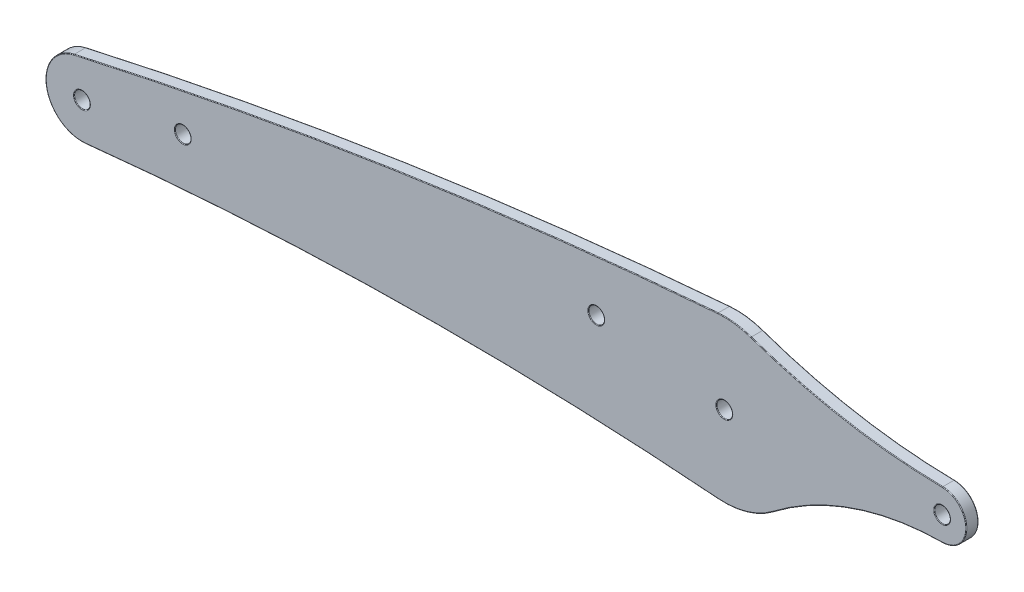
ISO-10303-21;
HEADER;
FILE_DESCRIPTION(('STEP AP214'),'2;1');
FILE_NAME('part.step','',(''),(''),'','','');
FILE_SCHEMA(('AUTOMOTIVE_DESIGN { 1 0 10303 214 1 1 1 1 }'));
ENDSEC;
DATA;
#1=APPLICATION_CONTEXT('core data for automotive mechanical design processes');
#2=APPLICATION_PROTOCOL_DEFINITION('international standard','automotive_design',2000,#1);
#3=PRODUCT_CONTEXT('',#1,'mechanical');
#4=PRODUCT('Part','Part','',(#3));
#5=PRODUCT_RELATED_PRODUCT_CATEGORY('part','',(#4));
#6=PRODUCT_DEFINITION_FORMATION('','',#4);
#7=PRODUCT_DEFINITION_CONTEXT('part definition',#1,'design');
#8=PRODUCT_DEFINITION('design','',#6,#7);
#9=PRODUCT_DEFINITION_SHAPE('','',#8);
#10=(LENGTH_UNIT() NAMED_UNIT(*) SI_UNIT(.MILLI.,.METRE.));
#11=(NAMED_UNIT(*) PLANE_ANGLE_UNIT() SI_UNIT($,.RADIAN.));
#12=(NAMED_UNIT(*) SI_UNIT($,.STERADIAN.) SOLID_ANGLE_UNIT());
#13=UNCERTAINTY_MEASURE_WITH_UNIT(LENGTH_MEASURE(1.E-05),#10,'distance_accuracy_value','');
#14=(GEOMETRIC_REPRESENTATION_CONTEXT(3) GLOBAL_UNCERTAINTY_ASSIGNED_CONTEXT((#13)) GLOBAL_UNIT_ASSIGNED_CONTEXT((#10,
#11,#12)) REPRESENTATION_CONTEXT('',''));
#15=CARTESIAN_POINT('',(0.,0.,0.));
#16=DIRECTION('',(0.,0.,1.));
#17=DIRECTION('',(1.,0.,0.));
#18=AXIS2_PLACEMENT_3D('',#15,#16,#17);
#19=CARTESIAN_POINT('',(-211.943109466389,188.84471337373,-3.));
#20=DIRECTION('',(0.,0.,1.));
#21=DIRECTION('',(1.,0.,0.));
#22=AXIS2_PLACEMENT_3D('',#19,#20,#21);
#23=CYLINDRICAL_SURFACE('',#22,9.00000000000004);
#24=DIRECTION('',(0.,0.,1.));
#25=VECTOR('',#24,1.);
#26=CARTESIAN_POINT('',(-213.918209682214,197.625315809636,-3.));
#27=LINE('',#26,#25);
#28=CARTESIAN_POINT('',(-213.918209682214,197.625315809636,-2.85));
#29=VERTEX_POINT('',#28);
#30=CARTESIAN_POINT('',(-213.918209682214,197.625315809636,-0.15));
#31=VERTEX_POINT('',#30);
#32=EDGE_CURVE('E152',#29,#31,#27,.T.);
#33=ORIENTED_EDGE('',*,*,#32,.F.);
#34=CARTESIAN_POINT('',(-211.943109466389,188.84471337373,-2.85));
#35=DIRECTION('',(0.,0.,1.));
#36=DIRECTION('',(1.,0.,0.));
#37=AXIS2_PLACEMENT_3D('',#34,#35,#36);
#38=CIRCLE('',#37,9.00000000000004);
#39=CARTESIAN_POINT('',(-210.990570029586,179.895262629615,-2.85));
#40=VERTEX_POINT('',#39);
#41=EDGE_CURVE('E147',#29,#40,#38,.T.);
#42=ORIENTED_EDGE('',*,*,#41,.T.);
#43=DIRECTION('',(0.,0.,1.));
#44=VECTOR('',#43,1.);
#45=CARTESIAN_POINT('',(-210.990570029586,179.895262629615,-3.));
#46=LINE('',#45,#44);
#47=CARTESIAN_POINT('',(-210.990570029586,179.895262629615,-0.15));
#48=VERTEX_POINT('',#47);
#49=EDGE_CURVE('E149',#40,#48,#46,.T.);
#50=ORIENTED_EDGE('',*,*,#49,.T.);
#51=CARTESIAN_POINT('',(-211.943109466389,188.84471337373,-0.15));
#52=DIRECTION('',(0.,0.,1.));
#53=DIRECTION('',(1.,0.,0.));
#54=AXIS2_PLACEMENT_3D('',#51,#52,#53);
#55=CIRCLE('',#54,9.00000000000004);
#56=EDGE_CURVE('E158',#48,#31,#55,.F.);
#57=ORIENTED_EDGE('',*,*,#56,.T.);
#58=EDGE_LOOP('',(#33,#42,#50,#57));
#59=FACE_BOUND('',#58,.T.);
#60=ADVANCED_FACE('F33',(#59),#23,.T.);
#61=CARTESIAN_POINT('',(38.4557067844307,-924.340551000619,-3.));
#62=DIRECTION('',(0.,0.,1.));
#63=DIRECTION('',(1.,0.,0.));
#64=AXIS2_PLACEMENT_3D('',#61,#62,#63);
#65=CYLINDRICAL_SURFACE('',#64,1150.);
#66=DIRECTION('',(0.,0.,1.));
#67=VECTOR('',#66,1.);
#68=CARTESIAN_POINT('',(-54.2798615977343,221.914269864636,-3.));
#69=LINE('',#68,#67);
#70=CARTESIAN_POINT('',(-54.2798615977343,221.914269864636,-2.85));
#71=VERTEX_POINT('',#70);
#72=CARTESIAN_POINT('',(-54.2798615977343,221.914269864636,-0.15));
#73=VERTEX_POINT('',#72);
#74=EDGE_CURVE('E369',#71,#73,#69,.T.);
#75=ORIENTED_EDGE('',*,*,#74,.F.);
#76=CARTESIAN_POINT('',(38.4557067844307,-924.340551000619,-2.85));
#77=DIRECTION('',(0.,0.,1.));
#78=DIRECTION('',(1.,0.,0.));
#79=AXIS2_PLACEMENT_3D('',#76,#77,#78);
#80=CIRCLE('',#79,1150.);
#81=EDGE_CURVE('E241',#71,#29,#80,.T.);
#82=ORIENTED_EDGE('',*,*,#81,.T.);
#83=ORIENTED_EDGE('',*,*,#32,.T.);
#84=CARTESIAN_POINT('',(38.4557067844307,-924.340551000619,-0.15));
#85=DIRECTION('',(0.,0.,1.));
#86=DIRECTION('',(1.,0.,0.));
#87=AXIS2_PLACEMENT_3D('',#84,#85,#86);
#88=CIRCLE('',#87,1150.);
#89=EDGE_CURVE('E238',#31,#73,#88,.F.);
#90=ORIENTED_EDGE('',*,*,#89,.T.);
#91=EDGE_LOOP('',(#75,#82,#83,#90));
#92=FACE_BOUND('',#91,.T.);
#93=ADVANCED_FACE('F375',(#92),#65,.T.);
#94=CARTESIAN_POINT('',(-52.6670691041315,201.979403414806,-3.));
#95=DIRECTION('',(0.,0.,1.));
#96=DIRECTION('',(1.,0.,0.));
#97=AXIS2_PLACEMENT_3D('',#94,#95,#96);
#98=CYLINDRICAL_SURFACE('',#97,19.9999999999998);
#99=DIRECTION('',(0.,0.,1.));
#100=VECTOR('',#99,1.);
#101=CARTESIAN_POINT('',(-46.0538445284684,220.854393764786,-3.));
#102=LINE('',#101,#100);
#103=CARTESIAN_POINT('',(-46.0538445284684,220.854393764786,-2.85));
#104=VERTEX_POINT('',#103);
#105=CARTESIAN_POINT('',(-46.0538445284684,220.854393764786,-0.15));
#106=VERTEX_POINT('',#105);
#107=EDGE_CURVE('E366',#104,#106,#102,.T.);
#108=ORIENTED_EDGE('',*,*,#107,.F.);
#109=CARTESIAN_POINT('',(-52.6670691041315,201.979403414806,-2.85));
#110=DIRECTION('',(0.,0.,1.));
#111=DIRECTION('',(1.,0.,0.));
#112=AXIS2_PLACEMENT_3D('',#109,#110,#111);
#113=CIRCLE('',#112,19.9999999999998);
#114=EDGE_CURVE('E236',#104,#71,#113,.T.);
#115=ORIENTED_EDGE('',*,*,#114,.T.);
#116=ORIENTED_EDGE('',*,*,#74,.T.);
#117=CARTESIAN_POINT('',(-52.6670691041315,201.979403414806,-0.15));
#118=DIRECTION('',(0.,0.,1.));
#119=DIRECTION('',(1.,0.,0.));
#120=AXIS2_PLACEMENT_3D('',#117,#118,#119);
#121=CIRCLE('',#120,19.9999999999998);
#122=EDGE_CURVE('E234',#73,#106,#121,.F.);
#123=ORIENTED_EDGE('',*,*,#122,.T.);
#124=EDGE_LOOP('',(#108,#115,#116,#123));
#125=FACE_BOUND('',#124,.T.);
#126=ADVANCED_FACE('F429',(#125),#98,.T.);
#127=CARTESIAN_POINT('',(3.54533978900547,362.416821389637,-3.));
#128=DIRECTION('',(0.,0.,1.));
#129=DIRECTION('',(1.,0.,0.));
#130=AXIS2_PLACEMENT_3D('',#127,#128,#129);
#131=CYLINDRICAL_SURFACE('',#130,150.);
#132=DIRECTION('',(0.,0.,1.));
#133=VECTOR('',#132,1.);
#134=CARTESIAN_POINT('',(1.41802354560448,212.431907062893,-3.));
#135=LINE('',#134,#133);
#136=CARTESIAN_POINT('',(1.41802354560448,212.431907062893,-2.85));
#137=VERTEX_POINT('',#136);
#138=CARTESIAN_POINT('',(1.41802354560448,212.431907062893,-0.15));
#139=VERTEX_POINT('',#138);
#140=EDGE_CURVE('E360',#137,#139,#135,.T.);
#141=ORIENTED_EDGE('',*,*,#140,.F.);
#142=CARTESIAN_POINT('',(3.54533978900547,362.416821389637,-2.85));
#143=DIRECTION('',(0.,0.,1.));
#144=DIRECTION('',(1.,0.,0.));
#145=AXIS2_PLACEMENT_3D('',#142,#143,#144);
#146=CIRCLE('',#145,150.);
#147=EDGE_CURVE('E232',#137,#104,#146,.F.);
#148=ORIENTED_EDGE('',*,*,#147,.T.);
#149=ORIENTED_EDGE('',*,*,#107,.T.);
#150=CARTESIAN_POINT('',(3.54533978900547,362.416821389637,-0.15));
#151=DIRECTION('',(0.,0.,1.));
#152=DIRECTION('',(1.,0.,0.));
#153=AXIS2_PLACEMENT_3D('',#150,#151,#152);
#154=CIRCLE('',#153,150.);
#155=EDGE_CURVE('E230',#106,#139,#154,.T.);
#156=ORIENTED_EDGE('',*,*,#155,.T.);
#157=EDGE_LOOP('',(#141,#148,#149,#156));
#158=FACE_BOUND('',#157,.T.);
#159=ADVANCED_FACE('F722',(#158),#131,.F.);
#160=CARTESIAN_POINT('',(1.33293089586844,206.432510489824,-3.));
#161=DIRECTION('',(0.,0.,1.));
#162=DIRECTION('',(1.,0.,0.));
#163=AXIS2_PLACEMENT_3D('',#160,#161,#162);
#164=CYLINDRICAL_SURFACE('',#163,5.99999999999999);
#165=DIRECTION('',(0.,0.,1.));
#166=VECTOR('',#165,1.);
#167=CARTESIAN_POINT('',(1.38046077506418,200.432698750228,-3.));
#168=LINE('',#167,#166);
#169=CARTESIAN_POINT('',(1.38046077506418,200.432698750228,-2.85));
#170=VERTEX_POINT('',#169);
#171=CARTESIAN_POINT('',(1.38046077506418,200.432698750228,-0.15));
#172=VERTEX_POINT('',#171);
#173=EDGE_CURVE('E356',#170,#172,#168,.T.);
#174=ORIENTED_EDGE('',*,*,#173,.F.);
#175=CARTESIAN_POINT('',(1.33293089586844,206.432510489824,-2.85));
#176=DIRECTION('',(0.,0.,1.));
#177=DIRECTION('',(1.,0.,0.));
#178=AXIS2_PLACEMENT_3D('',#175,#176,#177);
#179=CIRCLE('',#178,5.99999999999999);
#180=EDGE_CURVE('E228',#170,#137,#179,.T.);
#181=ORIENTED_EDGE('',*,*,#180,.T.);
#182=ORIENTED_EDGE('',*,*,#140,.T.);
#183=CARTESIAN_POINT('',(1.33293089586844,206.432510489824,-0.15));
#184=DIRECTION('',(0.,0.,1.));
#185=DIRECTION('',(1.,0.,0.));
#186=AXIS2_PLACEMENT_3D('',#183,#184,#185);
#187=CIRCLE('',#186,5.99999999999999);
#188=EDGE_CURVE('E226',#139,#172,#187,.F.);
#189=ORIENTED_EDGE('',*,*,#188,.T.);
#190=EDGE_LOOP('',(#174,#181,#182,#189));
#191=FACE_BOUND('',#190,.T.);
#192=ADVANCED_FACE('F714',(#191),#164,.T.);
#193=CARTESIAN_POINT('',(1.93497603234776,130.434895121619,-3.));
#194=DIRECTION('',(0.,0.,1.));
#195=DIRECTION('',(1.,0.,0.));
#196=AXIS2_PLACEMENT_3D('',#193,#194,#195);
#197=CYLINDRICAL_SURFACE('',#196,70.);
#198=DIRECTION('',(0.,0.,1.));
#199=VECTOR('',#198,1.);
#200=CARTESIAN_POINT('',(-40.5332812960251,186.080623794097,-3.));
#201=LINE('',#200,#199);
#202=CARTESIAN_POINT('',(-40.5332812960251,186.080623794097,-2.85));
#203=VERTEX_POINT('',#202);
#204=CARTESIAN_POINT('',(-40.5332812960251,186.080623794097,-0.15));
#205=VERTEX_POINT('',#204);
#206=EDGE_CURVE('E353',#203,#205,#201,.T.);
#207=ORIENTED_EDGE('',*,*,#206,.F.);
#208=CARTESIAN_POINT('',(1.93497603234776,130.434895121619,-2.85));
#209=DIRECTION('',(0.,0.,1.));
#210=DIRECTION('',(1.,0.,0.));
#211=AXIS2_PLACEMENT_3D('',#208,#209,#210);
#212=CIRCLE('',#211,70.);
#213=EDGE_CURVE('E224',#203,#170,#212,.F.);
#214=ORIENTED_EDGE('',*,*,#213,.T.);
#215=ORIENTED_EDGE('',*,*,#173,.T.);
#216=CARTESIAN_POINT('',(1.93497603234776,130.434895121619,-0.15));
#217=DIRECTION('',(0.,0.,1.));
#218=DIRECTION('',(1.,0.,0.));
#219=AXIS2_PLACEMENT_3D('',#216,#217,#218);
#220=CIRCLE('',#219,70.);
#221=EDGE_CURVE('E222',#172,#205,#220,.T.);
#222=ORIENTED_EDGE('',*,*,#221,.T.);
#223=EDGE_LOOP('',(#207,#214,#215,#222));
#224=FACE_BOUND('',#223,.T.);
#225=ADVANCED_FACE('F352',(#224),#197,.F.);
#226=CARTESIAN_POINT('',(-52.6670691041316,201.979403414805,-3.));
#227=DIRECTION('',(0.,0.,1.));
#228=DIRECTION('',(1.,0.,0.));
#229=AXIS2_PLACEMENT_3D('',#226,#227,#228);
#230=CYLINDRICAL_SURFACE('',#229,20.0000000000001);
#231=DIRECTION('',(0.,0.,1.));
#232=VECTOR('',#231,1.);
#233=CARTESIAN_POINT('',(-54.2385965295393,182.041241474667,-3.));
#234=LINE('',#233,#232);
#235=CARTESIAN_POINT('',(-54.2385965295393,182.041241474667,-2.85));
#236=VERTEX_POINT('',#235);
#237=CARTESIAN_POINT('',(-54.2385965295393,182.041241474667,-0.15));
#238=VERTEX_POINT('',#237);
#239=EDGE_CURVE('E169',#236,#238,#234,.T.);
#240=ORIENTED_EDGE('',*,*,#239,.F.);
#241=CARTESIAN_POINT('',(-52.6670691041316,201.979403414805,-2.85));
#242=DIRECTION('',(0.,0.,1.));
#243=DIRECTION('',(1.,0.,0.));
#244=AXIS2_PLACEMENT_3D('',#241,#242,#243);
#245=CIRCLE('',#244,20.0000000000001);
#246=EDGE_CURVE('E220',#236,#203,#245,.T.);
#247=ORIENTED_EDGE('',*,*,#246,.T.);
#248=ORIENTED_EDGE('',*,*,#206,.T.);
#249=CARTESIAN_POINT('',(-52.6670691041316,201.979403414805,-0.15));
#250=DIRECTION('',(0.,0.,1.));
#251=DIRECTION('',(1.,0.,0.));
#252=AXIS2_PLACEMENT_3D('',#249,#250,#251);
#253=CIRCLE('',#252,20.0000000000001);
#254=EDGE_CURVE('E218',#205,#238,#253,.F.);
#255=ORIENTED_EDGE('',*,*,#254,.T.);
#256=EDGE_LOOP('',(#240,#247,#248,#255));
#257=FACE_BOUND('',#256,.T.);
#258=ADVANCED_FACE('F358',(#257),#230,.T.);
#259=CARTESIAN_POINT('',(-121.028512109368,-665.330640981224,-3.));
#260=DIRECTION('',(0.,0.,1.));
#261=DIRECTION('',(1.,0.,0.));
#262=AXIS2_PLACEMENT_3D('',#259,#260,#261);
#263=CYLINDRICAL_SURFACE('',#262,850.);
#264=ORIENTED_EDGE('',*,*,#49,.F.);
#265=CARTESIAN_POINT('',(-121.028512109368,-665.330640981224,-2.85));
#266=DIRECTION('',(0.,0.,1.));
#267=DIRECTION('',(1.,0.,0.));
#268=AXIS2_PLACEMENT_3D('',#265,#266,#267);
#269=CIRCLE('',#268,850.);
#270=EDGE_CURVE('E165',#40,#236,#269,.F.);
#271=ORIENTED_EDGE('',*,*,#270,.T.);
#272=ORIENTED_EDGE('',*,*,#239,.T.);
#273=CARTESIAN_POINT('',(-121.028512109368,-665.330640981224,-0.15));
#274=DIRECTION('',(0.,0.,1.));
#275=DIRECTION('',(1.,0.,0.));
#276=AXIS2_PLACEMENT_3D('',#273,#274,#275);
#277=CIRCLE('',#276,850.);
#278=EDGE_CURVE('E168',#238,#48,#277,.T.);
#279=ORIENTED_EDGE('',*,*,#278,.T.);
#280=EDGE_LOOP('',(#264,#271,#272,#279));
#281=FACE_BOUND('',#280,.T.);
#282=ADVANCED_FACE('F162',(#281),#263,.F.);
#283=CARTESIAN_POINT('',(-166.485810787878,-238.242963803747,-3.));
#284=DIRECTION('',(0.,0.,1.));
#285=DIRECTION('',(1.,0.,0.));
#286=AXIS2_PLACEMENT_3D('',#283,#284,#285);
#287=PLANE('',#286);
#288=CARTESIAN_POINT('',(-52.6670691041316,201.979403414805,-3.));
#289=DIRECTION('',(0.,0.,1.));
#290=DIRECTION('',(1.,0.,0.));
#291=AXIS2_PLACEMENT_3D('',#288,#289,#290);
#292=CIRCLE('',#291,19.8500000000001);
#293=CARTESIAN_POINT('',(-40.6242847045858,186.199864641252,-3.));
#294=VERTEX_POINT('',#293);
#295=CARTESIAN_POINT('',(-54.2268100738487,182.190777689218,-3.));
#296=VERTEX_POINT('',#295);
#297=EDGE_CURVE('E214',#294,#296,#292,.F.);
#298=ORIENTED_EDGE('',*,*,#297,.T.);
#299=CARTESIAN_POINT('',(-121.028512109368,-665.330640981224,-3.));
#300=DIRECTION('',(0.,0.,1.));
#301=DIRECTION('',(1.,0.,0.));
#302=AXIS2_PLACEMENT_3D('',#299,#300,#301);
#303=CIRCLE('',#302,850.15);
#304=CARTESIAN_POINT('',(-211.006445686866,180.044420142017,-3.));
#305=VERTEX_POINT('',#304);
#306=EDGE_CURVE('E216',#296,#305,#303,.T.);
#307=ORIENTED_EDGE('',*,*,#306,.T.);
#308=CARTESIAN_POINT('',(-211.943109466389,188.84471337373,-3.));
#309=DIRECTION('',(0.,0.,1.));
#310=DIRECTION('',(1.,0.,0.));
#311=AXIS2_PLACEMENT_3D('',#308,#309,#310);
#312=CIRCLE('',#311,8.85000000000004);
#313=CARTESIAN_POINT('',(-213.885291345284,197.478972435705,-3.));
#314=VERTEX_POINT('',#313);
#315=EDGE_CURVE('E175',#305,#314,#312,.F.);
#316=ORIENTED_EDGE('',*,*,#315,.T.);
#317=CARTESIAN_POINT('',(38.4557067844307,-924.340551000619,-3.));
#318=DIRECTION('',(0.,0.,1.));
#319=DIRECTION('',(1.,0.,0.));
#320=AXIS2_PLACEMENT_3D('',#317,#318,#319);
#321=CIRCLE('',#320,1149.85);
#322=CARTESIAN_POINT('',(-54.2677656540323,221.764758366262,-3.));
#323=VERTEX_POINT('',#322);
#324=EDGE_CURVE('E204',#314,#323,#321,.F.);
#325=ORIENTED_EDGE('',*,*,#324,.T.);
#326=CARTESIAN_POINT('',(-52.6670691041315,201.979403414806,-3.));
#327=DIRECTION('',(0.,0.,1.));
#328=DIRECTION('',(1.,0.,0.));
#329=AXIS2_PLACEMENT_3D('',#326,#327,#328);
#330=CIRCLE('',#329,19.8499999999998);
#331=CARTESIAN_POINT('',(-46.1034437127859,220.712831337161,-3.));
#332=VERTEX_POINT('',#331);
#333=EDGE_CURVE('E206',#323,#332,#330,.F.);
#334=ORIENTED_EDGE('',*,*,#333,.T.);
#335=CARTESIAN_POINT('',(3.54533978900547,362.416821389637,-3.));
#336=DIRECTION('',(0.,0.,1.));
#337=DIRECTION('',(1.,0.,0.));
#338=AXIS2_PLACEMENT_3D('',#335,#336,#337);
#339=CIRCLE('',#338,150.15);
#340=CARTESIAN_POINT('',(1.41589622936108,212.281922148567,-3.));
#341=VERTEX_POINT('',#340);
#342=EDGE_CURVE('E208',#332,#341,#339,.T.);
#343=ORIENTED_EDGE('',*,*,#342,.T.);
#344=CARTESIAN_POINT('',(1.33293089586844,206.432510489824,-3.));
#345=DIRECTION('',(0.,0.,1.));
#346=DIRECTION('',(1.,0.,0.));
#347=AXIS2_PLACEMENT_3D('',#344,#345,#346);
#348=CIRCLE('',#347,5.84999999999999);
#349=CARTESIAN_POINT('',(1.37927252808429,200.582694043718,-3.));
#350=VERTEX_POINT('',#349);
#351=EDGE_CURVE('E210',#341,#350,#348,.F.);
#352=ORIENTED_EDGE('',*,*,#351,.T.);
#353=CARTESIAN_POINT('',(1.93497603234776,130.434895121619,-3.));
#354=DIRECTION('',(0.,0.,1.));
#355=DIRECTION('',(1.,0.,0.));
#356=AXIS2_PLACEMENT_3D('',#353,#354,#355);
#357=CIRCLE('',#356,70.15);
#358=EDGE_CURVE('E212',#350,#294,#357,.T.);
#359=ORIENTED_EDGE('',*,*,#358,.T.);
#360=EDGE_LOOP('',(#298,#307,#316,#325,#334,#343,#352,#359));
#361=FACE_BOUND('',#360,.T.);
#362=CARTESIAN_POINT('',(1.33293089586844,206.432510489824,-3.));
#363=DIRECTION('',(0.,0.,1.));
#364=DIRECTION('',(1.,0.,0.));
#365=AXIS2_PLACEMENT_3D('',#362,#363,#364);
#366=CIRCLE('',#365,2.09999999999999);
#367=CARTESIAN_POINT('',(3.43293089586843,206.432510489824,-3.));
#368=VERTEX_POINT('',#367);
#369=EDGE_CURVE('E200',#368,#368,#366,.T.);
#370=ORIENTED_EDGE('',*,*,#369,.T.);
#371=EDGE_LOOP('',(#370));
#372=FACE_BOUND('',#371,.T.);
#373=CARTESIAN_POINT('',(-52.6670691041316,201.979403414805,-3.));
#374=DIRECTION('',(0.,0.,1.));
#375=DIRECTION('',(1.,0.,0.));
#376=AXIS2_PLACEMENT_3D('',#373,#374,#375);
#377=CIRCLE('',#376,2.09999999999999);
#378=CARTESIAN_POINT('',(-50.5670691041316,201.979403414805,-3.));
#379=VERTEX_POINT('',#378);
#380=EDGE_CURVE('E197',#379,#379,#377,.T.);
#381=ORIENTED_EDGE('',*,*,#380,.T.);
#382=EDGE_LOOP('',(#381));
#383=FACE_BOUND('',#382,.T.);
#384=CARTESIAN_POINT('',(-84.4170691041315,206.371027021735,-3.));
#385=DIRECTION('',(0.,0.,1.));
#386=DIRECTION('',(1.,0.,0.));
#387=AXIS2_PLACEMENT_3D('',#384,#385,#386);
#388=CIRCLE('',#387,2.09999999999999);
#389=CARTESIAN_POINT('',(-82.3170691041316,206.371027021735,-3.));
#390=VERTEX_POINT('',#389);
#391=EDGE_CURVE('E194',#390,#390,#388,.T.);
#392=ORIENTED_EDGE('',*,*,#391,.T.);
#393=EDGE_LOOP('',(#392));
#394=FACE_BOUND('',#393,.T.);
#395=CARTESIAN_POINT('',(-186.943109466389,193.96421532943,-3.));
#396=DIRECTION('',(0.,0.,1.));
#397=DIRECTION('',(1.,0.,0.));
#398=AXIS2_PLACEMENT_3D('',#395,#396,#397);
#399=CIRCLE('',#398,2.09999999999998);
#400=CARTESIAN_POINT('',(-184.843109466389,193.96421532943,-3.));
#401=VERTEX_POINT('',#400);
#402=EDGE_CURVE('E188',#401,#401,#399,.T.);
#403=ORIENTED_EDGE('',*,*,#402,.T.);
#404=EDGE_LOOP('',(#403));
#405=FACE_BOUND('',#404,.T.);
#406=CARTESIAN_POINT('',(-211.943109466389,188.84471337373,-3.));
#407=DIRECTION('',(0.,0.,1.));
#408=DIRECTION('',(1.,0.,0.));
#409=AXIS2_PLACEMENT_3D('',#406,#407,#408);
#410=CIRCLE('',#409,2.09999999999998);
#411=CARTESIAN_POINT('',(-209.843109466389,188.84471337373,-3.));
#412=VERTEX_POINT('',#411);
#413=EDGE_CURVE('E185',#412,#412,#410,.T.);
#414=ORIENTED_EDGE('',*,*,#413,.T.);
#415=EDGE_LOOP('',(#414));
#416=FACE_BOUND('',#415,.T.);
#417=ADVANCED_FACE('F391',(#361,#372,#383,#394,#405,#416),#287,.F.);
#418=CARTESIAN_POINT('',(-166.485810787878,-238.242963803747,0.));
#419=DIRECTION('',(0.,0.,1.));
#420=DIRECTION('',(1.,0.,0.));
#421=AXIS2_PLACEMENT_3D('',#418,#419,#420);
#422=PLANE('',#421);
#423=CARTESIAN_POINT('',(-52.6670691041315,201.979403414806,0.));
#424=DIRECTION('',(0.,0.,1.));
#425=DIRECTION('',(1.,0.,0.));
#426=AXIS2_PLACEMENT_3D('',#423,#424,#425);
#427=CIRCLE('',#426,19.8499999999998);
#428=CARTESIAN_POINT('',(-46.1034437127859,220.712831337161,0.));
#429=VERTEX_POINT('',#428);
#430=CARTESIAN_POINT('',(-54.2677656540323,221.764758366262,0.));
#431=VERTEX_POINT('',#430);
#432=EDGE_CURVE('E42',#429,#431,#427,.T.);
#433=ORIENTED_EDGE('',*,*,#432,.T.);
#434=CARTESIAN_POINT('',(38.4557067844307,-924.340551000619,0.));
#435=DIRECTION('',(0.,0.,1.));
#436=DIRECTION('',(1.,0.,0.));
#437=AXIS2_PLACEMENT_3D('',#434,#435,#436);
#438=CIRCLE('',#437,1149.85);
#439=CARTESIAN_POINT('',(-213.885291345284,197.478972435705,0.));
#440=VERTEX_POINT('',#439);
#441=EDGE_CURVE('E11',#431,#440,#438,.T.);
#442=ORIENTED_EDGE('',*,*,#441,.T.);
#443=CARTESIAN_POINT('',(-211.943109466389,188.84471337373,0.));
#444=DIRECTION('',(0.,0.,1.));
#445=DIRECTION('',(1.,0.,0.));
#446=AXIS2_PLACEMENT_3D('',#443,#444,#445);
#447=CIRCLE('',#446,8.85000000000004);
#448=CARTESIAN_POINT('',(-211.006445686866,180.044420142017,0.));
#449=VERTEX_POINT('',#448);
#450=EDGE_CURVE('E288',#440,#449,#447,.T.);
#451=ORIENTED_EDGE('',*,*,#450,.T.);
#452=CARTESIAN_POINT('',(-121.028512109368,-665.330640981224,0.));
#453=DIRECTION('',(0.,0.,1.));
#454=DIRECTION('',(1.,0.,0.));
#455=AXIS2_PLACEMENT_3D('',#452,#453,#454);
#456=CIRCLE('',#455,850.15);
#457=CARTESIAN_POINT('',(-54.2268100738487,182.190777689218,0.));
#458=VERTEX_POINT('',#457);
#459=EDGE_CURVE('E290',#449,#458,#456,.F.);
#460=ORIENTED_EDGE('',*,*,#459,.T.);
#461=CARTESIAN_POINT('',(-52.6670691041316,201.979403414805,0.));
#462=DIRECTION('',(0.,0.,1.));
#463=DIRECTION('',(1.,0.,0.));
#464=AXIS2_PLACEMENT_3D('',#461,#462,#463);
#465=CIRCLE('',#464,19.8500000000001);
#466=CARTESIAN_POINT('',(-40.6242847045858,186.199864641252,0.));
#467=VERTEX_POINT('',#466);
#468=EDGE_CURVE('E292',#458,#467,#465,.T.);
#469=ORIENTED_EDGE('',*,*,#468,.T.);
#470=CARTESIAN_POINT('',(1.93497603234776,130.434895121619,0.));
#471=DIRECTION('',(0.,0.,1.));
#472=DIRECTION('',(1.,0.,0.));
#473=AXIS2_PLACEMENT_3D('',#470,#471,#472);
#474=CIRCLE('',#473,70.15);
#475=CARTESIAN_POINT('',(1.37927252808429,200.582694043718,0.));
#476=VERTEX_POINT('',#475);
#477=EDGE_CURVE('E294',#467,#476,#474,.F.);
#478=ORIENTED_EDGE('',*,*,#477,.T.);
#479=CARTESIAN_POINT('',(1.33293089586844,206.432510489824,0.));
#480=DIRECTION('',(0.,0.,1.));
#481=DIRECTION('',(1.,0.,0.));
#482=AXIS2_PLACEMENT_3D('',#479,#480,#481);
#483=CIRCLE('',#482,5.84999999999999);
#484=CARTESIAN_POINT('',(1.41589622936108,212.281922148567,0.));
#485=VERTEX_POINT('',#484);
#486=EDGE_CURVE('E296',#476,#485,#483,.T.);
#487=ORIENTED_EDGE('',*,*,#486,.T.);
#488=CARTESIAN_POINT('',(3.54533978900547,362.416821389637,0.));
#489=DIRECTION('',(0.,0.,1.));
#490=DIRECTION('',(1.,0.,0.));
#491=AXIS2_PLACEMENT_3D('',#488,#489,#490);
#492=CIRCLE('',#491,150.15);
#493=EDGE_CURVE('E53',#485,#429,#492,.F.);
#494=ORIENTED_EDGE('',*,*,#493,.T.);
#495=EDGE_LOOP('',(#433,#442,#451,#460,#469,#478,#487,#494));
#496=FACE_BOUND('',#495,.T.);
#497=CARTESIAN_POINT('',(1.33293089586844,206.432510489824,0.));
#498=DIRECTION('',(0.,0.,1.));
#499=DIRECTION('',(1.,0.,0.));
#500=AXIS2_PLACEMENT_3D('',#497,#498,#499);
#501=CIRCLE('',#500,2.09999999999999);
#502=CARTESIAN_POINT('',(3.43293089586843,206.432510489824,0.));
#503=VERTEX_POINT('',#502);
#504=EDGE_CURVE('E285',#503,#503,#501,.F.);
#505=ORIENTED_EDGE('',*,*,#504,.T.);
#506=EDGE_LOOP('',(#505));
#507=FACE_BOUND('',#506,.T.);
#508=CARTESIAN_POINT('',(-52.6670691041316,201.979403414805,0.));
#509=DIRECTION('',(0.,0.,1.));
#510=DIRECTION('',(1.,0.,0.));
#511=AXIS2_PLACEMENT_3D('',#508,#509,#510);
#512=CIRCLE('',#511,2.09999999999999);
#513=CARTESIAN_POINT('',(-50.5670691041316,201.979403414805,0.));
#514=VERTEX_POINT('',#513);
#515=EDGE_CURVE('E282',#514,#514,#512,.F.);
#516=ORIENTED_EDGE('',*,*,#515,.T.);
#517=EDGE_LOOP('',(#516));
#518=FACE_BOUND('',#517,.T.);
#519=CARTESIAN_POINT('',(-84.4170691041315,206.371027021735,0.));
#520=DIRECTION('',(0.,0.,1.));
#521=DIRECTION('',(1.,0.,0.));
#522=AXIS2_PLACEMENT_3D('',#519,#520,#521);
#523=CIRCLE('',#522,2.09999999999999);
#524=CARTESIAN_POINT('',(-82.3170691041316,206.371027021735,0.));
#525=VERTEX_POINT('',#524);
#526=EDGE_CURVE('E279',#525,#525,#523,.F.);
#527=ORIENTED_EDGE('',*,*,#526,.T.);
#528=EDGE_LOOP('',(#527));
#529=FACE_BOUND('',#528,.T.);
#530=CARTESIAN_POINT('',(-186.943109466389,193.96421532943,0.));
#531=DIRECTION('',(0.,0.,1.));
#532=DIRECTION('',(1.,0.,0.));
#533=AXIS2_PLACEMENT_3D('',#530,#531,#532);
#534=CIRCLE('',#533,2.09999999999998);
#535=CARTESIAN_POINT('',(-184.843109466389,193.96421532943,0.));
#536=VERTEX_POINT('',#535);
#537=EDGE_CURVE('E276',#536,#536,#534,.F.);
#538=ORIENTED_EDGE('',*,*,#537,.T.);
#539=EDGE_LOOP('',(#538));
#540=FACE_BOUND('',#539,.T.);
#541=CARTESIAN_POINT('',(-211.943109466389,188.84471337373,0.));
#542=DIRECTION('',(0.,0.,1.));
#543=DIRECTION('',(1.,0.,0.));
#544=AXIS2_PLACEMENT_3D('',#541,#542,#543);
#545=CIRCLE('',#544,2.09999999999998);
#546=CARTESIAN_POINT('',(-209.843109466389,188.84471337373,0.));
#547=VERTEX_POINT('',#546);
#548=EDGE_CURVE('E273',#547,#547,#545,.F.);
#549=ORIENTED_EDGE('',*,*,#548,.T.);
#550=EDGE_LOOP('',(#549));
#551=FACE_BOUND('',#550,.T.);
#552=ADVANCED_FACE('F387',(#496,#507,#518,#529,#540,#551),#422,.T.);
#553=CARTESIAN_POINT('',(1.33293089586844,206.432510489824,0.));
#554=DIRECTION('',(0.,0.,1.));
#555=DIRECTION('',(1.,0.,0.));
#556=AXIS2_PLACEMENT_3D('',#553,#554,#555);
#557=CYLINDRICAL_SURFACE('',#556,1.94999999999999);
#558=CARTESIAN_POINT('',(1.33293089586844,206.432510489824,-2.85));
#559=DIRECTION('',(0.,0.,1.));
#560=DIRECTION('',(1.,0.,0.));
#561=AXIS2_PLACEMENT_3D('',#558,#559,#560);
#562=CIRCLE('',#561,1.94999999999999);
#563=CARTESIAN_POINT('',(3.28293089586843,206.432510489824,-2.85));
#564=VERTEX_POINT('',#563);
#565=EDGE_CURVE('E246',#564,#564,#562,.F.);
#566=ORIENTED_EDGE('',*,*,#565,.T.);
#567=EDGE_LOOP('',(#566));
#568=FACE_BOUND('',#567,.T.);
#569=CARTESIAN_POINT('',(1.33293089586844,206.432510489824,-0.15));
#570=DIRECTION('',(0.,0.,1.));
#571=DIRECTION('',(1.,0.,0.));
#572=AXIS2_PLACEMENT_3D('',#569,#570,#571);
#573=CIRCLE('',#572,1.94999999999999);
#574=CARTESIAN_POINT('',(3.28293089586843,206.432510489824,-0.15));
#575=VERTEX_POINT('',#574);
#576=EDGE_CURVE('E157',#575,#575,#573,.T.);
#577=ORIENTED_EDGE('',*,*,#576,.T.);
#578=EDGE_LOOP('',(#577));
#579=FACE_BOUND('',#578,.T.);
#580=ADVANCED_FACE('F390',(#568,#579),#557,.F.);
#581=CARTESIAN_POINT('',(-52.6670691041316,201.979403414805,0.));
#582=DIRECTION('',(0.,0.,1.));
#583=DIRECTION('',(1.,0.,0.));
#584=AXIS2_PLACEMENT_3D('',#581,#582,#583);
#585=CYLINDRICAL_SURFACE('',#584,1.94999999999999);
#586=CARTESIAN_POINT('',(-52.6670691041316,201.979403414805,-2.85));
#587=DIRECTION('',(0.,0.,1.));
#588=DIRECTION('',(1.,0.,0.));
#589=AXIS2_PLACEMENT_3D('',#586,#587,#588);
#590=CIRCLE('',#589,1.94999999999999);
#591=CARTESIAN_POINT('',(-50.7170691041316,201.979403414805,-2.85));
#592=VERTEX_POINT('',#591);
#593=EDGE_CURVE('E252',#592,#592,#590,.F.);
#594=ORIENTED_EDGE('',*,*,#593,.T.);
#595=EDGE_LOOP('',(#594));
#596=FACE_BOUND('',#595,.T.);
#597=CARTESIAN_POINT('',(-52.6670691041316,201.979403414805,-0.15));
#598=DIRECTION('',(0.,0.,1.));
#599=DIRECTION('',(1.,0.,0.));
#600=AXIS2_PLACEMENT_3D('',#597,#598,#599);
#601=CIRCLE('',#600,1.94999999999999);
#602=CARTESIAN_POINT('',(-50.7170691041316,201.979403414805,-0.15));
#603=VERTEX_POINT('',#602);
#604=EDGE_CURVE('E249',#603,#603,#601,.T.);
#605=ORIENTED_EDGE('',*,*,#604,.T.);
#606=EDGE_LOOP('',(#605));
#607=FACE_BOUND('',#606,.T.);
#608=ADVANCED_FACE('F664',(#596,#607),#585,.F.);
#609=CARTESIAN_POINT('',(-84.4170691041315,206.371027021735,0.));
#610=DIRECTION('',(0.,0.,1.));
#611=DIRECTION('',(1.,0.,0.));
#612=AXIS2_PLACEMENT_3D('',#609,#610,#611);
#613=CYLINDRICAL_SURFACE('',#612,1.94999999999999);
#614=CARTESIAN_POINT('',(-84.4170691041315,206.371027021735,-2.85));
#615=DIRECTION('',(0.,0.,1.));
#616=DIRECTION('',(1.,0.,0.));
#617=AXIS2_PLACEMENT_3D('',#614,#615,#616);
#618=CIRCLE('',#617,1.94999999999999);
#619=CARTESIAN_POINT('',(-82.4670691041316,206.371027021735,-2.85));
#620=VERTEX_POINT('',#619);
#621=EDGE_CURVE('E258',#620,#620,#618,.F.);
#622=ORIENTED_EDGE('',*,*,#621,.T.);
#623=EDGE_LOOP('',(#622));
#624=FACE_BOUND('',#623,.T.);
#625=CARTESIAN_POINT('',(-84.4170691041315,206.371027021735,-0.15));
#626=DIRECTION('',(0.,0.,1.));
#627=DIRECTION('',(1.,0.,0.));
#628=AXIS2_PLACEMENT_3D('',#625,#626,#627);
#629=CIRCLE('',#628,1.94999999999999);
#630=CARTESIAN_POINT('',(-82.4670691041316,206.371027021735,-0.15));
#631=VERTEX_POINT('',#630);
#632=EDGE_CURVE('E255',#631,#631,#629,.T.);
#633=ORIENTED_EDGE('',*,*,#632,.T.);
#634=EDGE_LOOP('',(#633));
#635=FACE_BOUND('',#634,.T.);
#636=ADVANCED_FACE('F421',(#624,#635),#613,.F.);
#637=CARTESIAN_POINT('',(-186.943109466389,193.96421532943,0.));
#638=DIRECTION('',(0.,0.,1.));
#639=DIRECTION('',(1.,0.,0.));
#640=AXIS2_PLACEMENT_3D('',#637,#638,#639);
#641=CYLINDRICAL_SURFACE('',#640,1.94999999999998);
#642=CARTESIAN_POINT('',(-186.943109466389,193.96421532943,-2.85));
#643=DIRECTION('',(0.,0.,1.));
#644=DIRECTION('',(1.,0.,0.));
#645=AXIS2_PLACEMENT_3D('',#642,#643,#644);
#646=CIRCLE('',#645,1.94999999999998);
#647=CARTESIAN_POINT('',(-184.993109466389,193.96421532943,-2.85));
#648=VERTEX_POINT('',#647);
#649=EDGE_CURVE('E264',#648,#648,#646,.F.);
#650=ORIENTED_EDGE('',*,*,#649,.T.);
#651=EDGE_LOOP('',(#650));
#652=FACE_BOUND('',#651,.T.);
#653=CARTESIAN_POINT('',(-186.943109466389,193.96421532943,-0.15));
#654=DIRECTION('',(0.,0.,1.));
#655=DIRECTION('',(1.,0.,0.));
#656=AXIS2_PLACEMENT_3D('',#653,#654,#655);
#657=CIRCLE('',#656,1.94999999999998);
#658=CARTESIAN_POINT('',(-184.993109466389,193.96421532943,-0.15));
#659=VERTEX_POINT('',#658);
#660=EDGE_CURVE('E261',#659,#659,#657,.T.);
#661=ORIENTED_EDGE('',*,*,#660,.T.);
#662=EDGE_LOOP('',(#661));
#663=FACE_BOUND('',#662,.T.);
#664=ADVANCED_FACE('F411',(#652,#663),#641,.F.);
#665=CARTESIAN_POINT('',(-211.943109466389,188.84471337373,0.));
#666=DIRECTION('',(0.,0.,1.));
#667=DIRECTION('',(1.,0.,0.));
#668=AXIS2_PLACEMENT_3D('',#665,#666,#667);
#669=CYLINDRICAL_SURFACE('',#668,1.94999999999998);
#670=CARTESIAN_POINT('',(-211.943109466389,188.84471337373,-2.85));
#671=DIRECTION('',(0.,0.,1.));
#672=DIRECTION('',(1.,0.,0.));
#673=AXIS2_PLACEMENT_3D('',#670,#671,#672);
#674=CIRCLE('',#673,1.94999999999998);
#675=CARTESIAN_POINT('',(-209.993109466389,188.84471337373,-2.85));
#676=VERTEX_POINT('',#675);
#677=EDGE_CURVE('E270',#676,#676,#674,.F.);
#678=ORIENTED_EDGE('',*,*,#677,.T.);
#679=EDGE_LOOP('',(#678));
#680=FACE_BOUND('',#679,.T.);
#681=CARTESIAN_POINT('',(-211.943109466389,188.84471337373,-0.15));
#682=DIRECTION('',(0.,0.,1.));
#683=DIRECTION('',(1.,0.,0.));
#684=AXIS2_PLACEMENT_3D('',#681,#682,#683);
#685=CIRCLE('',#684,1.94999999999998);
#686=CARTESIAN_POINT('',(-209.993109466389,188.84471337373,-0.15));
#687=VERTEX_POINT('',#686);
#688=EDGE_CURVE('E267',#687,#687,#685,.T.);
#689=ORIENTED_EDGE('',*,*,#688,.T.);
#690=EDGE_LOOP('',(#689));
#691=FACE_BOUND('',#690,.T.);
#692=ADVANCED_FACE('F408',(#680,#691),#669,.F.);
#693=CARTESIAN_POINT('',(3.54533978900547,362.416821389637,-2.85));
#694=DIRECTION('',(0.,0.,1.));
#695=DIRECTION('',(1.,0.,0.));
#696=AXIS2_PLACEMENT_3D('',#693,#694,#695);
#697=TOROIDAL_SURFACE('',#696,150.15,0.15);
#698=CARTESIAN_POINT('',(1.41589622936108,212.281922148567,-2.85));
#699=DIRECTION('',(0.999899428844956,-0.0141821082893386,0.));
#700=DIRECTION('',(0.0141821082893386,0.999899428844956,0.));
#701=AXIS2_PLACEMENT_3D('',#698,#699,#700);
#702=CIRCLE('',#701,0.15);
#703=EDGE_CURVE('E311',#341,#137,#702,.T.);
#704=ORIENTED_EDGE('',*,*,#703,.F.);
#705=ORIENTED_EDGE('',*,*,#342,.F.);
#706=CARTESIAN_POINT('',(-46.1034437127859,220.712831337161,-2.85));
#707=DIRECTION('',(-0.943749517499015,0.330661228783142,0.));
#708=DIRECTION('',(-0.330661228783142,-0.943749517499015,0.));
#709=AXIS2_PLACEMENT_3D('',#706,#707,#708);
#710=CIRCLE('',#709,0.15);
#711=EDGE_CURVE('E170',#104,#332,#710,.T.);
#712=ORIENTED_EDGE('',*,*,#711,.F.);
#713=ORIENTED_EDGE('',*,*,#147,.F.);
#714=EDGE_LOOP('',(#704,#705,#712,#713));
#715=FACE_BOUND('',#714,.T.);
#716=ADVANCED_FACE('F410',(#715),#697,.T.);
#717=CARTESIAN_POINT('',(-52.6670691041315,201.979403414806,-2.85));
#718=DIRECTION('',(0.,0.,1.));
#719=DIRECTION('',(1.,0.,0.));
#720=AXIS2_PLACEMENT_3D('',#717,#718,#719);
#721=TOROIDAL_SURFACE('',#720,19.8499999999998,0.15);
#722=ORIENTED_EDGE('',*,*,#711,.T.);
#723=ORIENTED_EDGE('',*,*,#333,.F.);
#724=CARTESIAN_POINT('',(-54.2677656540323,221.764758366262,-2.85));
#725=DIRECTION('',(-0.996743322491525,-0.0806396246801564,0.));
#726=DIRECTION('',(0.0806396246801564,-0.996743322491525,0.));
#727=AXIS2_PLACEMENT_3D('',#724,#725,#726);
#728=CIRCLE('',#727,0.15);
#729=EDGE_CURVE('E308',#71,#323,#728,.T.);
#730=ORIENTED_EDGE('',*,*,#729,.F.);
#731=ORIENTED_EDGE('',*,*,#114,.F.);
#732=EDGE_LOOP('',(#722,#723,#730,#731));
#733=FACE_BOUND('',#732,.T.);
#734=ADVANCED_FACE('F418',(#733),#721,.T.);
#735=CARTESIAN_POINT('',(1.33293089586844,206.432510489824,-2.85));
#736=DIRECTION('',(0.,0.,1.));
#737=DIRECTION('',(1.,0.,0.));
#738=AXIS2_PLACEMENT_3D('',#735,#736,#737);
#739=TOROIDAL_SURFACE('',#738,5.84999999999999,0.15);
#740=ORIENTED_EDGE('',*,*,#703,.T.);
#741=ORIENTED_EDGE('',*,*,#180,.F.);
#742=CARTESIAN_POINT('',(1.37927252808429,200.582694043718,-2.85));
#743=DIRECTION('',(-0.999968623265856,-0.00792164653262237,0.));
#744=DIRECTION('',(0.00792164653262237,-0.999968623265856,0.));
#745=AXIS2_PLACEMENT_3D('',#742,#743,#744);
#746=CIRCLE('',#745,0.15);
#747=EDGE_CURVE('E305',#350,#170,#746,.T.);
#748=ORIENTED_EDGE('',*,*,#747,.F.);
#749=ORIENTED_EDGE('',*,*,#351,.F.);
#750=EDGE_LOOP('',(#740,#741,#748,#749));
#751=FACE_BOUND('',#750,.T.);
#752=ADVANCED_FACE('F450',(#751),#739,.T.);
#753=CARTESIAN_POINT('',(38.4557067844307,-924.340551000619,-2.85));
#754=DIRECTION('',(0.,0.,1.));
#755=DIRECTION('',(1.,0.,0.));
#756=AXIS2_PLACEMENT_3D('',#753,#754,#755);
#757=TOROIDAL_SURFACE('',#756,1149.85,0.15);
#758=ORIENTED_EDGE('',*,*,#729,.T.);
#759=ORIENTED_EDGE('',*,*,#324,.F.);
#760=CARTESIAN_POINT('',(-213.885291345284,197.478972435704,-2.85));
#761=DIRECTION('',(-0.975622492878497,-0.21945557953615,0.));
#762=DIRECTION('',(0.21945557953615,-0.975622492878497,0.));
#763=AXIS2_PLACEMENT_3D('',#760,#761,#762);
#764=CIRCLE('',#763,0.15);
#765=EDGE_CURVE('E303',#29,#314,#764,.T.);
#766=ORIENTED_EDGE('',*,*,#765,.F.);
#767=ORIENTED_EDGE('',*,*,#81,.F.);
#768=EDGE_LOOP('',(#758,#759,#766,#767));
#769=FACE_BOUND('',#768,.T.);
#770=ADVANCED_FACE('F446',(#769),#757,.T.);
#771=CARTESIAN_POINT('',(1.93497603234776,130.434895121619,-2.85));
#772=DIRECTION('',(0.,0.,1.));
#773=DIRECTION('',(1.,0.,0.));
#774=AXIS2_PLACEMENT_3D('',#771,#772,#773);
#775=TOROIDAL_SURFACE('',#774,70.15,0.15);
#776=ORIENTED_EDGE('',*,*,#747,.T.);
#777=ORIENTED_EDGE('',*,*,#213,.F.);
#778=CARTESIAN_POINT('',(-40.6242847045858,186.199864641252,-2.85));
#779=DIRECTION('',(-0.794938981035463,-0.606689390405255,0.));
#780=DIRECTION('',(0.606689390405255,-0.794938981035463,0.));
#781=AXIS2_PLACEMENT_3D('',#778,#779,#780);
#782=CIRCLE('',#781,0.15);
#783=EDGE_CURVE('E179',#294,#203,#782,.T.);
#784=ORIENTED_EDGE('',*,*,#783,.F.);
#785=ORIENTED_EDGE('',*,*,#358,.F.);
#786=EDGE_LOOP('',(#776,#777,#784,#785));
#787=FACE_BOUND('',#786,.T.);
#788=ADVANCED_FACE('F443',(#787),#775,.T.);
#789=CARTESIAN_POINT('',(-211.943109466389,188.84471337373,-2.85));
#790=DIRECTION('',(0.,0.,1.));
#791=DIRECTION('',(1.,0.,0.));
#792=AXIS2_PLACEMENT_3D('',#789,#790,#791);
#793=TOROIDAL_SURFACE('',#792,8.85000000000004,0.15);
#794=ORIENTED_EDGE('',*,*,#765,.T.);
#795=ORIENTED_EDGE('',*,*,#315,.F.);
#796=CARTESIAN_POINT('',(-211.006445686866,180.044420142017,-2.85));
#797=DIRECTION('',(0.994383416012754,0.105837715200232,0.));
#798=DIRECTION('',(-0.105837715200232,0.994383416012754,0.));
#799=AXIS2_PLACEMENT_3D('',#796,#797,#798);
#800=CIRCLE('',#799,0.15);
#801=EDGE_CURVE('E173',#40,#305,#800,.T.);
#802=ORIENTED_EDGE('',*,*,#801,.F.);
#803=ORIENTED_EDGE('',*,*,#41,.F.);
#804=EDGE_LOOP('',(#794,#795,#802,#803));
#805=FACE_BOUND('',#804,.T.);
#806=ADVANCED_FACE('F174',(#805),#793,.T.);
#807=CARTESIAN_POINT('',(-52.6670691041316,201.979403414805,-2.85));
#808=DIRECTION('',(0.,0.,1.));
#809=DIRECTION('',(1.,0.,0.));
#810=AXIS2_PLACEMENT_3D('',#807,#808,#809);
#811=TOROIDAL_SURFACE('',#810,19.8500000000001,0.15);
#812=ORIENTED_EDGE('',*,*,#783,.T.);
#813=ORIENTED_EDGE('',*,*,#246,.F.);
#814=CARTESIAN_POINT('',(-54.2268100738487,182.190777689218,-2.85));
#815=DIRECTION('',(-0.996908097006927,0.0785763712704187,0.));
#816=DIRECTION('',(-0.0785763712704187,-0.996908097006927,0.));
#817=AXIS2_PLACEMENT_3D('',#814,#815,#816);
#818=CIRCLE('',#817,0.15);
#819=EDGE_CURVE('E180',#296,#236,#818,.T.);
#820=ORIENTED_EDGE('',*,*,#819,.F.);
#821=ORIENTED_EDGE('',*,*,#297,.F.);
#822=EDGE_LOOP('',(#812,#813,#820,#821));
#823=FACE_BOUND('',#822,.T.);
#824=ADVANCED_FACE('F437',(#823),#811,.T.);
#825=CARTESIAN_POINT('',(-121.028512109368,-665.330640981224,-2.85));
#826=DIRECTION('',(0.,0.,1.));
#827=DIRECTION('',(1.,0.,0.));
#828=AXIS2_PLACEMENT_3D('',#825,#826,#827);
#829=TOROIDAL_SURFACE('',#828,850.15,0.15);
#830=ORIENTED_EDGE('',*,*,#801,.T.);
#831=ORIENTED_EDGE('',*,*,#306,.F.);
#832=ORIENTED_EDGE('',*,*,#819,.T.);
#833=ORIENTED_EDGE('',*,*,#270,.F.);
#834=EDGE_LOOP('',(#830,#831,#832,#833));
#835=FACE_BOUND('',#834,.T.);
#836=ADVANCED_FACE('F182',(#835),#829,.T.);
#837=CARTESIAN_POINT('',(1.33293089586844,206.432510489824,-2.85));
#838=DIRECTION('',(0.,0.,1.));
#839=DIRECTION('',(1.,0.,0.));
#840=AXIS2_PLACEMENT_3D('',#837,#838,#839);
#841=TOROIDAL_SURFACE('',#840,2.09999999999999,0.15);
#842=ORIENTED_EDGE('',*,*,#565,.F.);
#843=EDGE_LOOP('',(#842));
#844=FACE_BOUND('',#843,.T.);
#845=ORIENTED_EDGE('',*,*,#369,.F.);
#846=EDGE_LOOP('',(#845));
#847=FACE_BOUND('',#846,.T.);
#848=ADVANCED_FACE('F436',(#844,#847),#841,.T.);
#849=CARTESIAN_POINT('',(-52.6670691041316,201.979403414805,-2.85));
#850=DIRECTION('',(0.,0.,1.));
#851=DIRECTION('',(1.,0.,0.));
#852=AXIS2_PLACEMENT_3D('',#849,#850,#851);
#853=TOROIDAL_SURFACE('',#852,2.09999999999999,0.15);
#854=ORIENTED_EDGE('',*,*,#593,.F.);
#855=EDGE_LOOP('',(#854));
#856=FACE_BOUND('',#855,.T.);
#857=ORIENTED_EDGE('',*,*,#380,.F.);
#858=EDGE_LOOP('',(#857));
#859=FACE_BOUND('',#858,.T.);
#860=ADVANCED_FACE('F460',(#856,#859),#853,.T.);
#861=CARTESIAN_POINT('',(-84.4170691041315,206.371027021735,-2.85));
#862=DIRECTION('',(0.,0.,1.));
#863=DIRECTION('',(1.,0.,0.));
#864=AXIS2_PLACEMENT_3D('',#861,#862,#863);
#865=TOROIDAL_SURFACE('',#864,2.09999999999999,0.15);
#866=ORIENTED_EDGE('',*,*,#621,.F.);
#867=EDGE_LOOP('',(#866));
#868=FACE_BOUND('',#867,.T.);
#869=ORIENTED_EDGE('',*,*,#391,.F.);
#870=EDGE_LOOP('',(#869));
#871=FACE_BOUND('',#870,.T.);
#872=ADVANCED_FACE('F464',(#868,#871),#865,.T.);
#873=CARTESIAN_POINT('',(-186.943109466389,193.96421532943,-2.85));
#874=DIRECTION('',(0.,0.,1.));
#875=DIRECTION('',(1.,0.,0.));
#876=AXIS2_PLACEMENT_3D('',#873,#874,#875);
#877=TOROIDAL_SURFACE('',#876,2.09999999999998,0.15);
#878=ORIENTED_EDGE('',*,*,#649,.F.);
#879=EDGE_LOOP('',(#878));
#880=FACE_BOUND('',#879,.T.);
#881=ORIENTED_EDGE('',*,*,#402,.F.);
#882=EDGE_LOOP('',(#881));
#883=FACE_BOUND('',#882,.T.);
#884=ADVANCED_FACE('F468',(#880,#883),#877,.T.);
#885=CARTESIAN_POINT('',(-211.943109466389,188.84471337373,-2.85));
#886=DIRECTION('',(0.,0.,1.));
#887=DIRECTION('',(1.,0.,0.));
#888=AXIS2_PLACEMENT_3D('',#885,#886,#887);
#889=TOROIDAL_SURFACE('',#888,2.09999999999998,0.15);
#890=ORIENTED_EDGE('',*,*,#677,.F.);
#891=EDGE_LOOP('',(#890));
#892=FACE_BOUND('',#891,.T.);
#893=ORIENTED_EDGE('',*,*,#413,.F.);
#894=EDGE_LOOP('',(#893));
#895=FACE_BOUND('',#894,.T.);
#896=ADVANCED_FACE('F472',(#892,#895),#889,.T.);
#897=CARTESIAN_POINT('',(1.93497603234776,130.434895121619,-0.15));
#898=DIRECTION('',(0.,0.,1.));
#899=DIRECTION('',(1.,0.,0.));
#900=AXIS2_PLACEMENT_3D('',#897,#898,#899);
#901=TOROIDAL_SURFACE('',#900,70.15,0.15);
#902=CARTESIAN_POINT('',(-40.6242847045858,186.199864641252,-0.15));
#903=DIRECTION('',(-0.794938981035418,-0.606689390405313,0.));
#904=DIRECTION('',(0.606689390405313,-0.794938981035418,0.));
#905=AXIS2_PLACEMENT_3D('',#902,#903,#904);
#906=CIRCLE('',#905,0.15);
#907=EDGE_CURVE('E331',#205,#467,#906,.T.);
#908=ORIENTED_EDGE('',*,*,#907,.F.);
#909=ORIENTED_EDGE('',*,*,#221,.F.);
#910=CARTESIAN_POINT('',(1.37927252808429,200.582694043718,-0.15));
#911=DIRECTION('',(0.999968623265856,0.00792164653262239,0.));
#912=DIRECTION('',(-0.00792164653262239,0.999968623265856,0.));
#913=AXIS2_PLACEMENT_3D('',#910,#911,#912);
#914=CIRCLE('',#913,0.15);
#915=EDGE_CURVE('E37',#476,#172,#914,.T.);
#916=ORIENTED_EDGE('',*,*,#915,.F.);
#917=ORIENTED_EDGE('',*,*,#477,.F.);
#918=EDGE_LOOP('',(#908,#909,#916,#917));
#919=FACE_BOUND('',#918,.T.);
#920=ADVANCED_FACE('F347',(#919),#901,.T.);
#921=CARTESIAN_POINT('',(1.33293089586844,206.432510489824,-0.15));
#922=DIRECTION('',(0.,0.,1.));
#923=DIRECTION('',(1.,0.,0.));
#924=AXIS2_PLACEMENT_3D('',#921,#922,#923);
#925=TOROIDAL_SURFACE('',#924,5.84999999999999,0.15);
#926=ORIENTED_EDGE('',*,*,#915,.T.);
#927=ORIENTED_EDGE('',*,*,#188,.F.);
#928=CARTESIAN_POINT('',(1.41589622936108,212.281922148567,-0.15));
#929=DIRECTION('',(-0.999899428844956,0.01418210828934,0.));
#930=DIRECTION('',(-0.01418210828934,-0.999899428844956,0.));
#931=AXIS2_PLACEMENT_3D('',#928,#929,#930);
#932=CIRCLE('',#931,0.15);
#933=EDGE_CURVE('E329',#485,#139,#932,.T.);
#934=ORIENTED_EDGE('',*,*,#933,.F.);
#935=ORIENTED_EDGE('',*,*,#486,.F.);
#936=EDGE_LOOP('',(#926,#927,#934,#935));
#937=FACE_BOUND('',#936,.T.);
#938=ADVANCED_FACE('F342',(#937),#925,.T.);
#939=CARTESIAN_POINT('',(-52.6670691041316,201.979403414805,-0.15));
#940=DIRECTION('',(0.,0.,1.));
#941=DIRECTION('',(1.,0.,0.));
#942=AXIS2_PLACEMENT_3D('',#939,#940,#941);
#943=TOROIDAL_SURFACE('',#942,19.8500000000001,0.15);
#944=ORIENTED_EDGE('',*,*,#907,.T.);
#945=ORIENTED_EDGE('',*,*,#468,.F.);
#946=CARTESIAN_POINT('',(-54.2268100738487,182.190777689218,-0.15));
#947=DIRECTION('',(-0.996908097006929,0.0785763712704042,0.));
#948=DIRECTION('',(-0.0785763712704042,-0.996908097006929,0.));
#949=AXIS2_PLACEMENT_3D('',#946,#947,#948);
#950=CIRCLE('',#949,0.15);
#951=EDGE_CURVE('E326',#238,#458,#950,.T.);
#952=ORIENTED_EDGE('',*,*,#951,.F.);
#953=ORIENTED_EDGE('',*,*,#254,.F.);
#954=EDGE_LOOP('',(#944,#945,#952,#953));
#955=FACE_BOUND('',#954,.T.);
#956=ADVANCED_FACE('F493',(#955),#943,.T.);
#957=CARTESIAN_POINT('',(3.54533978900547,362.416821389637,-0.15));
#958=DIRECTION('',(0.,0.,1.));
#959=DIRECTION('',(1.,0.,0.));
#960=AXIS2_PLACEMENT_3D('',#957,#958,#959);
#961=TOROIDAL_SURFACE('',#960,150.15,0.15);
#962=ORIENTED_EDGE('',*,*,#933,.T.);
#963=ORIENTED_EDGE('',*,*,#155,.F.);
#964=CARTESIAN_POINT('',(-46.1034437127859,220.712831337161,-0.15));
#965=DIRECTION('',(-0.943749517499,0.330661228783183,0.));
#966=DIRECTION('',(-0.330661228783183,-0.943749517499,0.));
#967=AXIS2_PLACEMENT_3D('',#964,#965,#966);
#968=CIRCLE('',#967,0.15);
#969=EDGE_CURVE('E323',#429,#106,#968,.T.);
#970=ORIENTED_EDGE('',*,*,#969,.F.);
#971=ORIENTED_EDGE('',*,*,#493,.F.);
#972=EDGE_LOOP('',(#962,#963,#970,#971));
#973=FACE_BOUND('',#972,.T.);
#974=ADVANCED_FACE('F489',(#973),#961,.T.);
#975=CARTESIAN_POINT('',(-121.028512109368,-665.330640981224,-0.15));
#976=DIRECTION('',(0.,0.,1.));
#977=DIRECTION('',(1.,0.,0.));
#978=AXIS2_PLACEMENT_3D('',#975,#976,#977);
#979=TOROIDAL_SURFACE('',#978,850.15,0.15);
#980=ORIENTED_EDGE('',*,*,#951,.T.);
#981=ORIENTED_EDGE('',*,*,#459,.F.);
#982=CARTESIAN_POINT('',(-211.006445686866,180.044420142017,-0.15));
#983=DIRECTION('',(-0.994383416012754,-0.105837715200232,0.));
#984=DIRECTION('',(0.105837715200232,-0.994383416012754,0.));
#985=AXIS2_PLACEMENT_3D('',#982,#983,#984);
#986=CIRCLE('',#985,0.15);
#987=EDGE_CURVE('E320',#48,#449,#986,.T.);
#988=ORIENTED_EDGE('',*,*,#987,.F.);
#989=ORIENTED_EDGE('',*,*,#278,.F.);
#990=EDGE_LOOP('',(#980,#981,#988,#989));
#991=FACE_BOUND('',#990,.T.);
#992=ADVANCED_FACE('F485',(#991),#979,.T.);
#993=CARTESIAN_POINT('',(-52.6670691041315,201.979403414806,-0.15));
#994=DIRECTION('',(0.,0.,1.));
#995=DIRECTION('',(1.,0.,0.));
#996=AXIS2_PLACEMENT_3D('',#993,#994,#995);
#997=TOROIDAL_SURFACE('',#996,19.8499999999998,0.15);
#998=ORIENTED_EDGE('',*,*,#969,.T.);
#999=ORIENTED_EDGE('',*,*,#122,.F.);
#1000=CARTESIAN_POINT('',(-54.2677656540323,221.764758366262,-0.15));
#1001=DIRECTION('',(-0.996743322491526,-0.0806396246801415,0.));
#1002=DIRECTION('',(0.0806396246801415,-0.996743322491526,0.));
#1003=AXIS2_PLACEMENT_3D('',#1000,#1001,#1002);
#1004=CIRCLE('',#1003,0.15);
#1005=EDGE_CURVE('E318',#431,#73,#1004,.T.);
#1006=ORIENTED_EDGE('',*,*,#1005,.F.);
#1007=ORIENTED_EDGE('',*,*,#432,.F.);
#1008=EDGE_LOOP('',(#998,#999,#1006,#1007));
#1009=FACE_BOUND('',#1008,.T.);
#1010=ADVANCED_FACE('F482',(#1009),#997,.T.);
#1011=CARTESIAN_POINT('',(-211.943109466389,188.84471337373,-0.15));
#1012=DIRECTION('',(0.,0.,1.));
#1013=DIRECTION('',(1.,0.,0.));
#1014=AXIS2_PLACEMENT_3D('',#1011,#1012,#1013);
#1015=TOROIDAL_SURFACE('',#1014,8.85000000000004,0.15);
#1016=ORIENTED_EDGE('',*,*,#987,.T.);
#1017=ORIENTED_EDGE('',*,*,#450,.F.);
#1018=CARTESIAN_POINT('',(-213.885291345284,197.478972435705,-0.15));
#1019=DIRECTION('',(0.975622492878497,0.21945557953615,0.));
#1020=DIRECTION('',(-0.21945557953615,0.975622492878497,0.));
#1021=AXIS2_PLACEMENT_3D('',#1018,#1019,#1020);
#1022=CIRCLE('',#1021,0.15);
#1023=EDGE_CURVE('E316',#31,#440,#1022,.T.);
#1024=ORIENTED_EDGE('',*,*,#1023,.F.);
#1025=ORIENTED_EDGE('',*,*,#56,.F.);
#1026=EDGE_LOOP('',(#1016,#1017,#1024,#1025));
#1027=FACE_BOUND('',#1026,.T.);
#1028=ADVANCED_FACE('F385',(#1027),#1015,.T.);
#1029=CARTESIAN_POINT('',(38.4557067844307,-924.340551000619,-0.15));
#1030=DIRECTION('',(0.,0.,1.));
#1031=DIRECTION('',(1.,0.,0.));
#1032=AXIS2_PLACEMENT_3D('',#1029,#1030,#1031);
#1033=TOROIDAL_SURFACE('',#1032,1149.85,0.15);
#1034=ORIENTED_EDGE('',*,*,#1005,.T.);
#1035=ORIENTED_EDGE('',*,*,#89,.F.);
#1036=ORIENTED_EDGE('',*,*,#1023,.T.);
#1037=ORIENTED_EDGE('',*,*,#441,.F.);
#1038=EDGE_LOOP('',(#1034,#1035,#1036,#1037));
#1039=FACE_BOUND('',#1038,.T.);
#1040=ADVANCED_FACE('F379',(#1039),#1033,.T.);
#1041=CARTESIAN_POINT('',(1.33293089586844,206.432510489824,-0.15));
#1042=DIRECTION('',(0.,0.,1.));
#1043=DIRECTION('',(1.,0.,0.));
#1044=AXIS2_PLACEMENT_3D('',#1041,#1042,#1043);
#1045=TOROIDAL_SURFACE('',#1044,2.09999999999999,0.15);
#1046=ORIENTED_EDGE('',*,*,#504,.F.);
#1047=EDGE_LOOP('',(#1046));
#1048=FACE_BOUND('',#1047,.T.);
#1049=ORIENTED_EDGE('',*,*,#576,.F.);
#1050=EDGE_LOOP('',(#1049));
#1051=FACE_BOUND('',#1050,.T.);
#1052=ADVANCED_FACE('F479',(#1048,#1051),#1045,.T.);
#1053=CARTESIAN_POINT('',(-52.6670691041316,201.979403414805,-0.15));
#1054=DIRECTION('',(0.,0.,1.));
#1055=DIRECTION('',(1.,0.,0.));
#1056=AXIS2_PLACEMENT_3D('',#1053,#1054,#1055);
#1057=TOROIDAL_SURFACE('',#1056,2.09999999999999,0.15);
#1058=ORIENTED_EDGE('',*,*,#515,.F.);
#1059=EDGE_LOOP('',(#1058));
#1060=FACE_BOUND('',#1059,.T.);
#1061=ORIENTED_EDGE('',*,*,#604,.F.);
#1062=EDGE_LOOP('',(#1061));
#1063=FACE_BOUND('',#1062,.T.);
#1064=ADVANCED_FACE('F503',(#1060,#1063),#1057,.T.);
#1065=CARTESIAN_POINT('',(-84.4170691041315,206.371027021735,-0.15));
#1066=DIRECTION('',(0.,0.,1.));
#1067=DIRECTION('',(1.,0.,0.));
#1068=AXIS2_PLACEMENT_3D('',#1065,#1066,#1067);
#1069=TOROIDAL_SURFACE('',#1068,2.09999999999999,0.15);
#1070=ORIENTED_EDGE('',*,*,#526,.F.);
#1071=EDGE_LOOP('',(#1070));
#1072=FACE_BOUND('',#1071,.T.);
#1073=ORIENTED_EDGE('',*,*,#632,.F.);
#1074=EDGE_LOOP('',(#1073));
#1075=FACE_BOUND('',#1074,.T.);
#1076=ADVANCED_FACE('F507',(#1072,#1075),#1069,.T.);
#1077=CARTESIAN_POINT('',(-186.943109466389,193.96421532943,-0.15));
#1078=DIRECTION('',(0.,0.,1.));
#1079=DIRECTION('',(1.,0.,0.));
#1080=AXIS2_PLACEMENT_3D('',#1077,#1078,#1079);
#1081=TOROIDAL_SURFACE('',#1080,2.09999999999998,0.15);
#1082=ORIENTED_EDGE('',*,*,#537,.F.);
#1083=EDGE_LOOP('',(#1082));
#1084=FACE_BOUND('',#1083,.T.);
#1085=ORIENTED_EDGE('',*,*,#660,.F.);
#1086=EDGE_LOOP('',(#1085));
#1087=FACE_BOUND('',#1086,.T.);
#1088=ADVANCED_FACE('F405',(#1084,#1087),#1081,.T.);
#1089=CARTESIAN_POINT('',(-211.943109466389,188.84471337373,-0.15));
#1090=DIRECTION('',(0.,0.,1.));
#1091=DIRECTION('',(1.,0.,0.));
#1092=AXIS2_PLACEMENT_3D('',#1089,#1090,#1091);
#1093=TOROIDAL_SURFACE('',#1092,2.09999999999998,0.15);
#1094=ORIENTED_EDGE('',*,*,#548,.F.);
#1095=EDGE_LOOP('',(#1094));
#1096=FACE_BOUND('',#1095,.T.);
#1097=ORIENTED_EDGE('',*,*,#688,.F.);
#1098=EDGE_LOOP('',(#1097));
#1099=FACE_BOUND('',#1098,.T.);
#1100=ADVANCED_FACE('F35',(#1096,#1099),#1093,.T.);
#1101=CLOSED_SHELL('',(#60,#93,#126,#159,#192,#225,#258,#282,#417,#552,#580,#608,#636,#664,#692,
#716,#734,#752,#770,#788,#806,#824,#836,#848,#860,#872,#884,#896,#920,#938,#956,#974,#992,#1010,
#1028,#1040,#1052,#1064,#1076,#1088,#1100));
#1102=MANIFOLD_SOLID_BREP('B2',#1101);
#1103=ADVANCED_BREP_SHAPE_REPRESENTATION('',(#18,#1102),#14);
#1104=SHAPE_DEFINITION_REPRESENTATION(#9,#1103);
ENDSEC;
END-ISO-10303-21;
